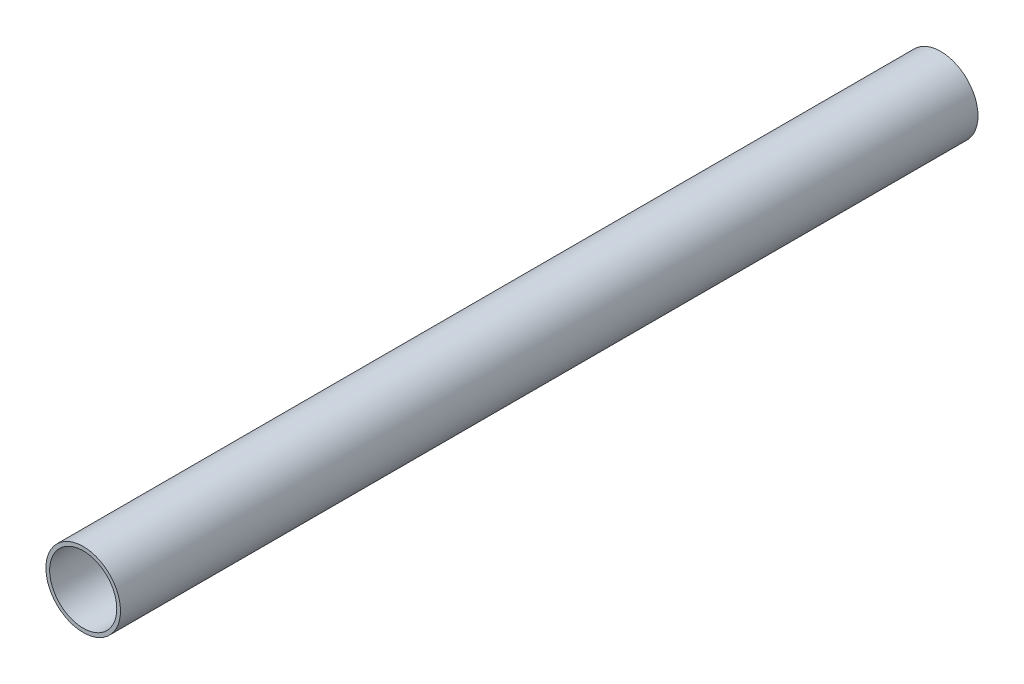
ISO-10303-21;
HEADER;
FILE_DESCRIPTION(('STEP AP214'),'2;1');
FILE_NAME('part.step','',(''),(''),'','','');
FILE_SCHEMA(('AUTOMOTIVE_DESIGN { 1 0 10303 214 1 1 1 1 }'));
ENDSEC;
DATA;
#1=APPLICATION_CONTEXT('core data for automotive mechanical design processes');
#2=APPLICATION_PROTOCOL_DEFINITION('international standard','automotive_design',2000,#1);
#3=PRODUCT_CONTEXT('',#1,'mechanical');
#4=PRODUCT('Part','Part','',(#3));
#5=PRODUCT_RELATED_PRODUCT_CATEGORY('part','',(#4));
#6=PRODUCT_DEFINITION_FORMATION('','',#4);
#7=PRODUCT_DEFINITION_CONTEXT('part definition',#1,'design');
#8=PRODUCT_DEFINITION('design','',#6,#7);
#9=PRODUCT_DEFINITION_SHAPE('','',#8);
#10=(LENGTH_UNIT() NAMED_UNIT(*) SI_UNIT(.MILLI.,.METRE.));
#11=(NAMED_UNIT(*) PLANE_ANGLE_UNIT() SI_UNIT($,.RADIAN.));
#12=(NAMED_UNIT(*) SI_UNIT($,.STERADIAN.) SOLID_ANGLE_UNIT());
#13=UNCERTAINTY_MEASURE_WITH_UNIT(LENGTH_MEASURE(1.E-05),#10,'distance_accuracy_value','');
#14=(GEOMETRIC_REPRESENTATION_CONTEXT(3) GLOBAL_UNCERTAINTY_ASSIGNED_CONTEXT((#13)) GLOBAL_UNIT_ASSIGNED_CONTEXT((#10,
#11,#12)) REPRESENTATION_CONTEXT('',''));
#15=CARTESIAN_POINT('',(0.,0.,0.));
#16=DIRECTION('',(0.,0.,1.));
#17=DIRECTION('',(1.,0.,0.));
#18=AXIS2_PLACEMENT_3D('',#15,#16,#17);
#19=CARTESIAN_POINT('',(0.,0.,230.));
#20=DIRECTION('',(0.,0.,1.));
#21=DIRECTION('',(1.,0.,0.));
#22=AXIS2_PLACEMENT_3D('',#19,#20,#21);
#23=PLANE('',#22);
#24=CARTESIAN_POINT('',(0.,0.,230.));
#25=DIRECTION('',(0.,0.,1.));
#26=DIRECTION('',(1.,0.,0.));
#27=AXIS2_PLACEMENT_3D('',#24,#25,#26);
#28=CIRCLE('',#27,10.);
#29=CARTESIAN_POINT('',(10.,0.,230.));
#30=VERTEX_POINT('',#29);
#31=EDGE_CURVE('E10',#30,#30,#28,.T.);
#32=ORIENTED_EDGE('',*,*,#31,.T.);
#33=EDGE_LOOP('',(#32));
#34=FACE_BOUND('',#33,.T.);
#35=CARTESIAN_POINT('',(0.,0.,230.));
#36=DIRECTION('',(0.,0.,1.));
#37=DIRECTION('',(1.,0.,0.));
#38=AXIS2_PLACEMENT_3D('',#35,#36,#37);
#39=CIRCLE('',#38,9.);
#40=CARTESIAN_POINT('',(9.,0.,230.));
#41=VERTEX_POINT('',#40);
#42=EDGE_CURVE('E43',#41,#41,#39,.T.);
#43=ORIENTED_EDGE('',*,*,#42,.F.);
#44=EDGE_LOOP('',(#43));
#45=FACE_BOUND('',#44,.T.);
#46=ADVANCED_FACE('F32',(#34,#45),#23,.T.);
#47=CARTESIAN_POINT('',(0.,0.,0.));
#48=DIRECTION('',(0.,0.,1.));
#49=DIRECTION('',(1.,0.,0.));
#50=AXIS2_PLACEMENT_3D('',#47,#48,#49);
#51=PLANE('',#50);
#52=CARTESIAN_POINT('',(0.,0.,0.));
#53=DIRECTION('',(0.,0.,1.));
#54=DIRECTION('',(1.,0.,0.));
#55=AXIS2_PLACEMENT_3D('',#52,#53,#54);
#56=CIRCLE('',#55,10.);
#57=CARTESIAN_POINT('',(10.,0.,0.));
#58=VERTEX_POINT('',#57);
#59=EDGE_CURVE('E36',#58,#58,#56,.T.);
#60=ORIENTED_EDGE('',*,*,#59,.F.);
#61=EDGE_LOOP('',(#60));
#62=FACE_BOUND('',#61,.T.);
#63=CARTESIAN_POINT('',(0.,0.,0.));
#64=DIRECTION('',(0.,0.,1.));
#65=DIRECTION('',(1.,0.,0.));
#66=AXIS2_PLACEMENT_3D('',#63,#64,#65);
#67=CIRCLE('',#66,9.);
#68=CARTESIAN_POINT('',(9.,0.,0.));
#69=VERTEX_POINT('',#68);
#70=EDGE_CURVE('E45',#69,#69,#67,.T.);
#71=ORIENTED_EDGE('',*,*,#70,.T.);
#72=EDGE_LOOP('',(#71));
#73=FACE_BOUND('',#72,.T.);
#74=ADVANCED_FACE('F55',(#62,#73),#51,.F.);
#75=CARTESIAN_POINT('',(0.,0.,230.));
#76=DIRECTION('',(0.,0.,-1.));
#77=DIRECTION('',(-1.,0.,0.));
#78=AXIS2_PLACEMENT_3D('',#75,#76,#77);
#79=CYLINDRICAL_SURFACE('',#78,10.);
#80=ORIENTED_EDGE('',*,*,#31,.F.);
#81=EDGE_LOOP('',(#80));
#82=FACE_BOUND('',#81,.T.);
#83=ORIENTED_EDGE('',*,*,#59,.T.);
#84=EDGE_LOOP('',(#83));
#85=FACE_BOUND('',#84,.T.);
#86=ADVANCED_FACE('F34',(#82,#85),#79,.T.);
#87=CARTESIAN_POINT('',(0.,0.,230.));
#88=DIRECTION('',(0.,0.,-1.));
#89=DIRECTION('',(-1.,0.,0.));
#90=AXIS2_PLACEMENT_3D('',#87,#88,#89);
#91=CYLINDRICAL_SURFACE('',#90,9.);
#92=ORIENTED_EDGE('',*,*,#42,.T.);
#93=EDGE_LOOP('',(#92));
#94=FACE_BOUND('',#93,.T.);
#95=ORIENTED_EDGE('',*,*,#70,.F.);
#96=EDGE_LOOP('',(#95));
#97=FACE_BOUND('',#96,.T.);
#98=ADVANCED_FACE('F51',(#94,#97),#91,.F.);
#99=CLOSED_SHELL('',(#46,#74,#86,#98));
#100=MANIFOLD_SOLID_BREP('B2',#99);
#101=ADVANCED_BREP_SHAPE_REPRESENTATION('',(#18,#100),#14);
#102=SHAPE_DEFINITION_REPRESENTATION(#9,#101);
ENDSEC;
END-ISO-10303-21;
